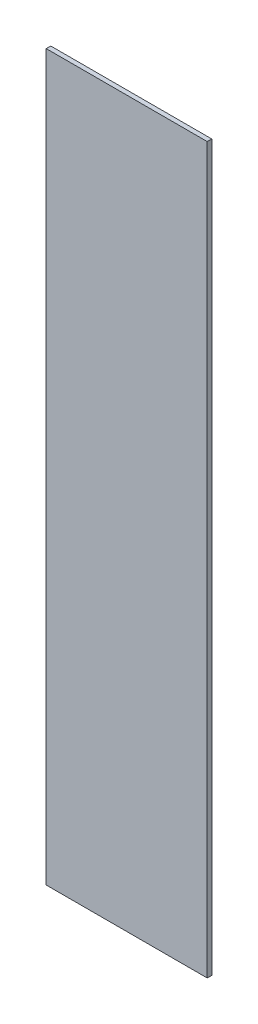
ISO-10303-21;
HEADER;
FILE_DESCRIPTION(('STEP AP214'),'2;1');
FILE_NAME('part.step','',(''),(''),'','','');
FILE_SCHEMA(('AUTOMOTIVE_DESIGN { 1 0 10303 214 1 1 1 1 }'));
ENDSEC;
DATA;
#1=APPLICATION_CONTEXT('core data for automotive mechanical design processes');
#2=APPLICATION_PROTOCOL_DEFINITION('international standard','automotive_design',2000,#1);
#3=PRODUCT_CONTEXT('',#1,'mechanical');
#4=PRODUCT('Part','Part','',(#3));
#5=PRODUCT_RELATED_PRODUCT_CATEGORY('part','',(#4));
#6=PRODUCT_DEFINITION_FORMATION('','',#4);
#7=PRODUCT_DEFINITION_CONTEXT('part definition',#1,'design');
#8=PRODUCT_DEFINITION('design','',#6,#7);
#9=PRODUCT_DEFINITION_SHAPE('','',#8);
#10=(LENGTH_UNIT() NAMED_UNIT(*) SI_UNIT(.MILLI.,.METRE.));
#11=(NAMED_UNIT(*) PLANE_ANGLE_UNIT() SI_UNIT($,.RADIAN.));
#12=(NAMED_UNIT(*) SI_UNIT($,.STERADIAN.) SOLID_ANGLE_UNIT());
#13=UNCERTAINTY_MEASURE_WITH_UNIT(LENGTH_MEASURE(1.E-05),#10,'distance_accuracy_value','');
#14=(GEOMETRIC_REPRESENTATION_CONTEXT(3) GLOBAL_UNCERTAINTY_ASSIGNED_CONTEXT((#13)) GLOBAL_UNIT_ASSIGNED_CONTEXT((#10,
#11,#12)) REPRESENTATION_CONTEXT('',''));
#15=CARTESIAN_POINT('',(0.,0.,0.));
#16=DIRECTION('',(0.,0.,1.));
#17=DIRECTION('',(1.,0.,0.));
#18=AXIS2_PLACEMENT_3D('',#15,#16,#17);
#19=CARTESIAN_POINT('',(-0.1778,0.8001,0.01));
#20=DIRECTION('',(0.,0.,1.));
#21=DIRECTION('',(1.,0.,0.));
#22=AXIS2_PLACEMENT_3D('',#19,#20,#21);
#23=PLANE('',#22);
#24=DIRECTION('',(0.,1.,0.));
#25=VECTOR('',#24,1.);
#26=CARTESIAN_POINT('',(0.1778,0.8001,0.01));
#27=LINE('',#26,#25);
#28=CARTESIAN_POINT('',(0.1778,0.8001,0.01));
#29=VERTEX_POINT('',#28);
#30=CARTESIAN_POINT('',(0.1778,-0.8001,0.01));
#31=VERTEX_POINT('',#30);
#32=EDGE_CURVE('E53',#29,#31,#27,.F.);
#33=ORIENTED_EDGE('',*,*,#32,.F.);
#34=DIRECTION('',(1.,0.,0.));
#35=VECTOR('',#34,1.);
#36=CARTESIAN_POINT('',(-0.1778,0.8001,0.01));
#37=LINE('',#36,#35);
#38=CARTESIAN_POINT('',(-0.1778,0.8001,0.01));
#39=VERTEX_POINT('',#38);
#40=EDGE_CURVE('E20',#29,#39,#37,.F.);
#41=ORIENTED_EDGE('',*,*,#40,.T.);
#42=DIRECTION('',(0.,1.,0.));
#43=VECTOR('',#42,1.);
#44=CARTESIAN_POINT('',(-0.1778,-0.8001,0.01));
#45=LINE('',#44,#43);
#46=CARTESIAN_POINT('',(-0.1778,-0.8001,0.01));
#47=VERTEX_POINT('',#46);
#48=EDGE_CURVE('E67',#47,#39,#45,.T.);
#49=ORIENTED_EDGE('',*,*,#48,.F.);
#50=DIRECTION('',(1.,0.,0.));
#51=VECTOR('',#50,1.);
#52=CARTESIAN_POINT('',(0.1778,-0.8001,0.01));
#53=LINE('',#52,#51);
#54=EDGE_CURVE('E58',#31,#47,#53,.F.);
#55=ORIENTED_EDGE('',*,*,#54,.F.);
#56=EDGE_LOOP('',(#33,#41,#49,#55));
#57=FACE_BOUND('',#56,.T.);
#58=ADVANCED_FACE('F17',(#57),#23,.T.);
#59=CARTESIAN_POINT('',(-0.1778,-0.8001,0.));
#60=DIRECTION('',(-1.,0.,0.));
#61=DIRECTION('',(0.,0.,1.));
#62=AXIS2_PLACEMENT_3D('',#59,#60,#61);
#63=PLANE('',#62);
#64=DIRECTION('',(0.,0.,1.));
#65=VECTOR('',#64,1.);
#66=CARTESIAN_POINT('',(-0.1778,0.8001,0.));
#67=LINE('',#66,#65);
#68=CARTESIAN_POINT('',(-0.1778,0.8001,0.));
#69=VERTEX_POINT('',#68);
#70=EDGE_CURVE('E80',#69,#39,#67,.T.);
#71=ORIENTED_EDGE('',*,*,#70,.F.);
#72=DIRECTION('',(0.,1.,0.));
#73=VECTOR('',#72,1.);
#74=CARTESIAN_POINT('',(-0.1778,0.8001,0.));
#75=LINE('',#74,#73);
#76=CARTESIAN_POINT('',(-0.1778,-0.8001,0.));
#77=VERTEX_POINT('',#76);
#78=EDGE_CURVE('E75',#69,#77,#75,.F.);
#79=ORIENTED_EDGE('',*,*,#78,.T.);
#80=DIRECTION('',(0.,0.,-1.));
#81=VECTOR('',#80,1.);
#82=CARTESIAN_POINT('',(-0.1778,-0.8001,0.));
#83=LINE('',#82,#81);
#84=EDGE_CURVE('E63',#47,#77,#83,.T.);
#85=ORIENTED_EDGE('',*,*,#84,.F.);
#86=ORIENTED_EDGE('',*,*,#48,.T.);
#87=EDGE_LOOP('',(#71,#79,#85,#86));
#88=FACE_BOUND('',#87,.T.);
#89=ADVANCED_FACE('F74',(#88),#63,.T.);
#90=CARTESIAN_POINT('',(0.1778,-0.8001,0.));
#91=DIRECTION('',(0.,-1.,0.));
#92=DIRECTION('',(0.,0.,-1.));
#93=AXIS2_PLACEMENT_3D('',#90,#91,#92);
#94=PLANE('',#93);
#95=ORIENTED_EDGE('',*,*,#84,.T.);
#96=DIRECTION('',(1.,0.,0.));
#97=VECTOR('',#96,1.);
#98=CARTESIAN_POINT('',(-0.1778,-0.8001,0.));
#99=LINE('',#98,#97);
#100=CARTESIAN_POINT('',(0.1778,-0.8001,0.));
#101=VERTEX_POINT('',#100);
#102=EDGE_CURVE('E84',#77,#101,#99,.T.);
#103=ORIENTED_EDGE('',*,*,#102,.T.);
#104=DIRECTION('',(0.,0.,-1.));
#105=VECTOR('',#104,1.);
#106=CARTESIAN_POINT('',(0.1778,-0.8001,0.));
#107=LINE('',#106,#105);
#108=EDGE_CURVE('E65',#31,#101,#107,.T.);
#109=ORIENTED_EDGE('',*,*,#108,.F.);
#110=ORIENTED_EDGE('',*,*,#54,.T.);
#111=EDGE_LOOP('',(#95,#103,#109,#110));
#112=FACE_BOUND('',#111,.T.);
#113=ADVANCED_FACE('F60',(#112),#94,.T.);
#114=CARTESIAN_POINT('',(0.1778,0.8001,0.));
#115=DIRECTION('',(1.,0.,0.));
#116=DIRECTION('',(0.,0.,-1.));
#117=AXIS2_PLACEMENT_3D('',#114,#115,#116);
#118=PLANE('',#117);
#119=ORIENTED_EDGE('',*,*,#108,.T.);
#120=DIRECTION('',(0.,1.,0.));
#121=VECTOR('',#120,1.);
#122=CARTESIAN_POINT('',(0.1778,0.8001,0.));
#123=LINE('',#122,#121);
#124=CARTESIAN_POINT('',(0.1778,0.8001,0.));
#125=VERTEX_POINT('',#124);
#126=EDGE_CURVE('E26',#101,#125,#123,.T.);
#127=ORIENTED_EDGE('',*,*,#126,.T.);
#128=DIRECTION('',(0.,0.,1.));
#129=VECTOR('',#128,1.);
#130=CARTESIAN_POINT('',(0.1778,0.8001,0.));
#131=LINE('',#130,#129);
#132=EDGE_CURVE('E34',#29,#125,#131,.F.);
#133=ORIENTED_EDGE('',*,*,#132,.F.);
#134=ORIENTED_EDGE('',*,*,#32,.T.);
#135=EDGE_LOOP('',(#119,#127,#133,#134));
#136=FACE_BOUND('',#135,.T.);
#137=ADVANCED_FACE('F88',(#136),#118,.T.);
#138=CARTESIAN_POINT('',(-0.1778,0.8001,0.));
#139=DIRECTION('',(0.,1.,0.));
#140=DIRECTION('',(0.,0.,1.));
#141=AXIS2_PLACEMENT_3D('',#138,#139,#140);
#142=PLANE('',#141);
#143=ORIENTED_EDGE('',*,*,#132,.T.);
#144=DIRECTION('',(1.,0.,0.));
#145=VECTOR('',#144,1.);
#146=CARTESIAN_POINT('',(-0.1778,0.8001,0.));
#147=LINE('',#146,#145);
#148=EDGE_CURVE('E11',#125,#69,#147,.F.);
#149=ORIENTED_EDGE('',*,*,#148,.T.);
#150=ORIENTED_EDGE('',*,*,#70,.T.);
#151=ORIENTED_EDGE('',*,*,#40,.F.);
#152=EDGE_LOOP('',(#143,#149,#150,#151));
#153=FACE_BOUND('',#152,.T.);
#154=ADVANCED_FACE('F91',(#153),#142,.T.);
#155=CARTESIAN_POINT('',(-0.1778,0.8001,0.));
#156=DIRECTION('',(0.,0.,1.));
#157=DIRECTION('',(1.,0.,0.));
#158=AXIS2_PLACEMENT_3D('',#155,#156,#157);
#159=PLANE('',#158);
#160=ORIENTED_EDGE('',*,*,#126,.F.);
#161=ORIENTED_EDGE('',*,*,#102,.F.);
#162=ORIENTED_EDGE('',*,*,#78,.F.);
#163=ORIENTED_EDGE('',*,*,#148,.F.);
#164=EDGE_LOOP('',(#160,#161,#162,#163));
#165=FACE_BOUND('',#164,.T.);
#166=ADVANCED_FACE('F90',(#165),#159,.F.);
#167=CLOSED_SHELL('',(#58,#89,#113,#137,#154,#166));
#168=MANIFOLD_SOLID_BREP('B1',#167);
#169=ADVANCED_BREP_SHAPE_REPRESENTATION('',(#18,#168),#14);
#170=SHAPE_DEFINITION_REPRESENTATION(#9,#169);
ENDSEC;
END-ISO-10303-21;
